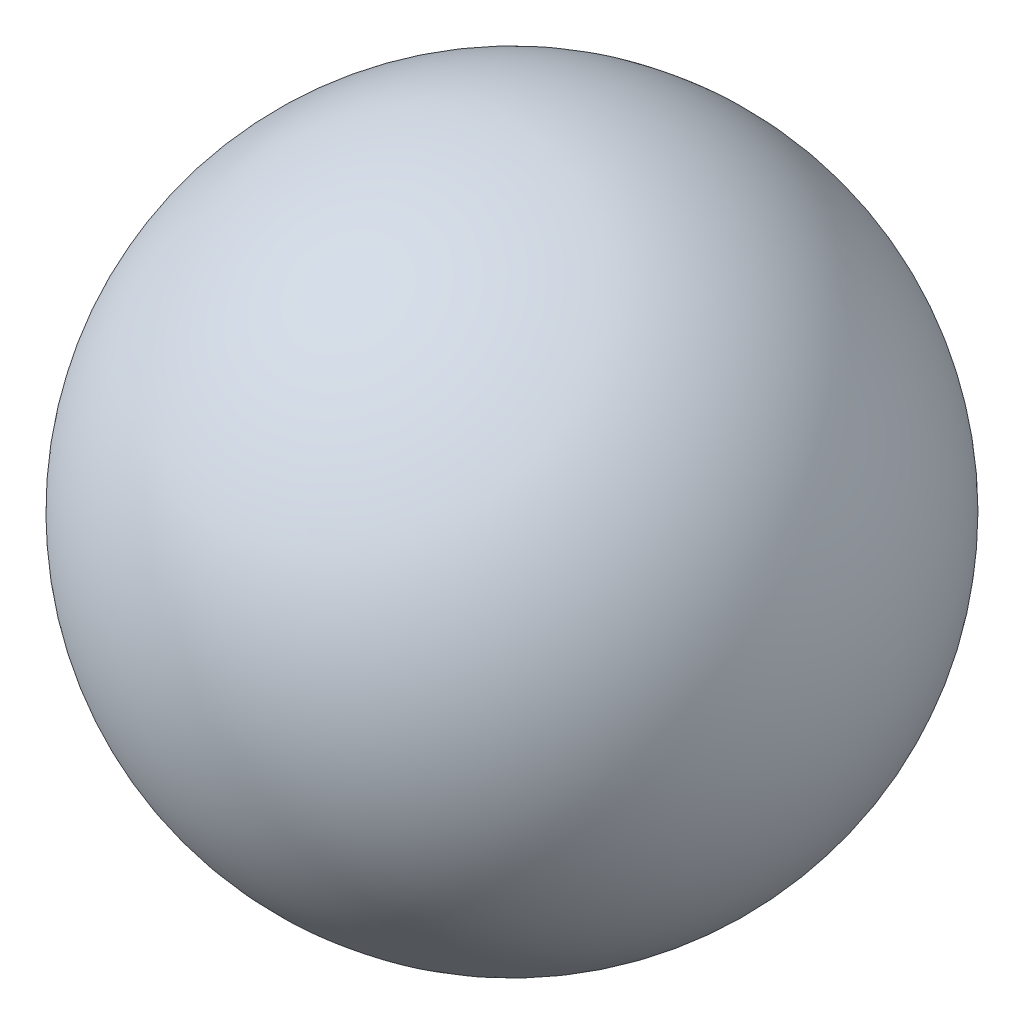
ISO-10303-21;
HEADER;
FILE_DESCRIPTION(('STEP AP214'),'2;1');
FILE_NAME('part.step','',(''),(''),'','','');
FILE_SCHEMA(('AUTOMOTIVE_DESIGN { 1 0 10303 214 1 1 1 1 }'));
ENDSEC;
DATA;
#1=APPLICATION_CONTEXT('core data for automotive mechanical design processes');
#2=APPLICATION_PROTOCOL_DEFINITION('international standard','automotive_design',2000,#1);
#3=PRODUCT_CONTEXT('',#1,'mechanical');
#4=PRODUCT('Part','Part','',(#3));
#5=PRODUCT_RELATED_PRODUCT_CATEGORY('part','',(#4));
#6=PRODUCT_DEFINITION_FORMATION('','',#4);
#7=PRODUCT_DEFINITION_CONTEXT('part definition',#1,'design');
#8=PRODUCT_DEFINITION('design','',#6,#7);
#9=PRODUCT_DEFINITION_SHAPE('','',#8);
#10=(LENGTH_UNIT() NAMED_UNIT(*) SI_UNIT(.MILLI.,.METRE.));
#11=(NAMED_UNIT(*) PLANE_ANGLE_UNIT() SI_UNIT($,.RADIAN.));
#12=(NAMED_UNIT(*) SI_UNIT($,.STERADIAN.) SOLID_ANGLE_UNIT());
#13=UNCERTAINTY_MEASURE_WITH_UNIT(LENGTH_MEASURE(1.E-05),#10,'distance_accuracy_value','');
#14=(GEOMETRIC_REPRESENTATION_CONTEXT(3) GLOBAL_UNCERTAINTY_ASSIGNED_CONTEXT((#13)) GLOBAL_UNIT_ASSIGNED_CONTEXT((#10,
#11,#12)) REPRESENTATION_CONTEXT('',''));
#15=CARTESIAN_POINT('',(0.,0.,0.));
#16=DIRECTION('',(0.,0.,1.));
#17=DIRECTION('',(1.,0.,0.));
#18=AXIS2_PLACEMENT_3D('',#15,#16,#17);
#19=CARTESIAN_POINT('',(57.535,54.8778641215452,-27.8306579459995));
#20=DIRECTION('',(0.,0.891866184337212,-0.452299357987365));
#21=DIRECTION('',(0.173648177666933,0.445427914428401,0.878316732984701));
#22=AXIS2_PLACEMENT_3D('',#19,#20,#21);
#23=SPHERICAL_SURFACE('',#22,6.75);
#24=CARTESIAN_POINT('',(57.535,48.857767377269,-24.7776372795848));
#25=VERTEX_POINT('',#24);
#26=VERTEX_LOOP('',#25);
#27=FACE_BOUND('',#26,.T.);
#28=CARTESIAN_POINT('',(57.535,60.8979608658214,-30.8836786124142));
#29=VERTEX_POINT('',#28);
#30=VERTEX_LOOP('',#29);
#31=FACE_BOUND('',#30,.T.);
#32=ADVANCED_FACE('F16',(#27,#31),#23,.T.);
#33=CLOSED_SHELL('',(#32));
#34=MANIFOLD_SOLID_BREP('B1',#33);
#35=ADVANCED_BREP_SHAPE_REPRESENTATION('',(#18,#34),#14);
#36=SHAPE_DEFINITION_REPRESENTATION(#9,#35);
ENDSEC;
END-ISO-10303-21;
